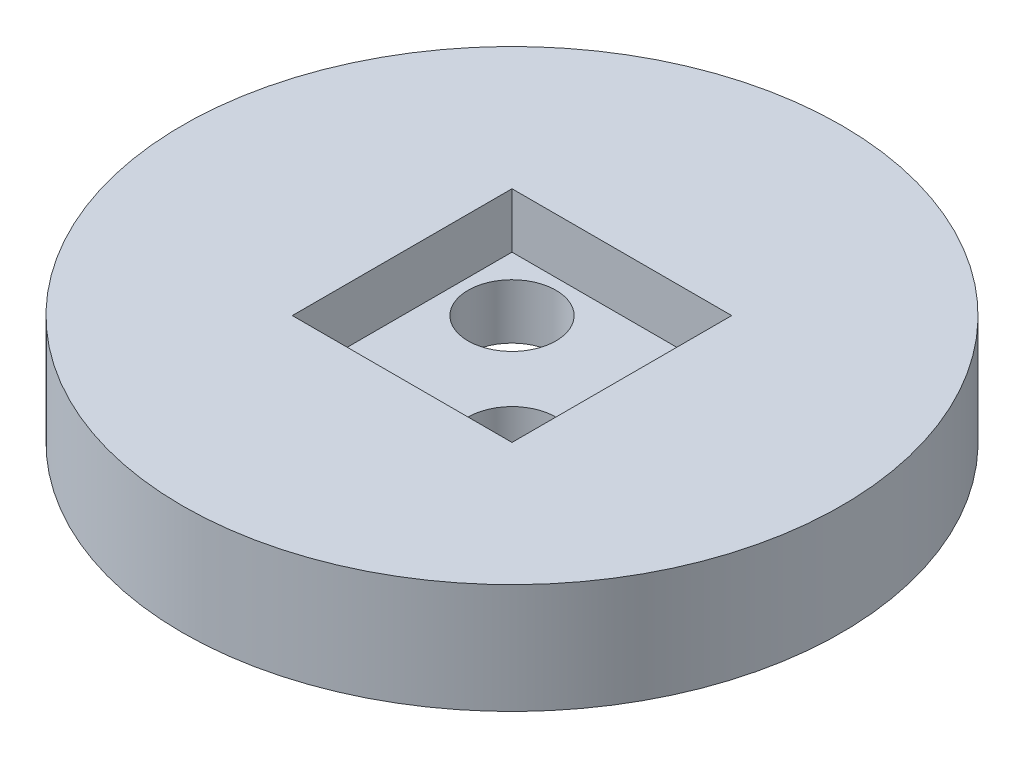
ISO-10303-21;
HEADER;
FILE_DESCRIPTION(('STEP AP214'),'2;1');
FILE_NAME('part.step','',(''),(''),'','','');
FILE_SCHEMA(('AUTOMOTIVE_DESIGN { 1 0 10303 214 1 1 1 1 }'));
ENDSEC;
DATA;
#1=APPLICATION_CONTEXT('core data for automotive mechanical design processes');
#2=APPLICATION_PROTOCOL_DEFINITION('international standard','automotive_design',2000,#1);
#3=PRODUCT_CONTEXT('',#1,'mechanical');
#4=PRODUCT('Part','Part','',(#3));
#5=PRODUCT_RELATED_PRODUCT_CATEGORY('part','',(#4));
#6=PRODUCT_DEFINITION_FORMATION('','',#4);
#7=PRODUCT_DEFINITION_CONTEXT('part definition',#1,'design');
#8=PRODUCT_DEFINITION('design','',#6,#7);
#9=PRODUCT_DEFINITION_SHAPE('','',#8);
#10=(LENGTH_UNIT() NAMED_UNIT(*) SI_UNIT(.MILLI.,.METRE.));
#11=(NAMED_UNIT(*) PLANE_ANGLE_UNIT() SI_UNIT($,.RADIAN.));
#12=(NAMED_UNIT(*) SI_UNIT($,.STERADIAN.) SOLID_ANGLE_UNIT());
#13=UNCERTAINTY_MEASURE_WITH_UNIT(LENGTH_MEASURE(1.E-05),#10,'distance_accuracy_value','');
#14=(GEOMETRIC_REPRESENTATION_CONTEXT(3) GLOBAL_UNCERTAINTY_ASSIGNED_CONTEXT((#13)) GLOBAL_UNIT_ASSIGNED_CONTEXT((#10,
#11,#12)) REPRESENTATION_CONTEXT('',''));
#15=CARTESIAN_POINT('',(0.,0.,0.));
#16=DIRECTION('',(0.,0.,1.));
#17=DIRECTION('',(1.,0.,0.));
#18=AXIS2_PLACEMENT_3D('',#15,#16,#17);
#19=CARTESIAN_POINT('',(0.,5.,0.));
#20=DIRECTION('',(0.,1.,0.));
#21=DIRECTION('',(0.,0.,1.));
#22=AXIS2_PLACEMENT_3D('',#19,#20,#21);
#23=PLANE('',#22);
#24=CARTESIAN_POINT('',(0.,5.,0.));
#25=DIRECTION('',(0.,1.,0.));
#26=DIRECTION('',(0.,0.,1.));
#27=AXIS2_PLACEMENT_3D('',#24,#25,#26);
#28=CIRCLE('',#27,15.);
#29=CARTESIAN_POINT('',(0.,5.,15.));
#30=VERTEX_POINT('',#29);
#31=EDGE_CURVE('E11',#30,#30,#28,.T.);
#32=ORIENTED_EDGE('',*,*,#31,.T.);
#33=EDGE_LOOP('',(#32));
#34=FACE_BOUND('',#33,.T.);
#35=DIRECTION('',(1.,0.,0.));
#36=VECTOR('',#35,1.);
#37=CARTESIAN_POINT('',(5.,5.,5.));
#38=LINE('',#37,#36);
#39=CARTESIAN_POINT('',(-5.,5.,5.));
#40=VERTEX_POINT('',#39);
#41=CARTESIAN_POINT('',(5.,5.,5.));
#42=VERTEX_POINT('',#41);
#43=EDGE_CURVE('E118',#40,#42,#38,.T.);
#44=ORIENTED_EDGE('',*,*,#43,.F.);
#45=DIRECTION('',(0.,0.,1.));
#46=VECTOR('',#45,1.);
#47=CARTESIAN_POINT('',(-5.,5.,5.));
#48=LINE('',#47,#46);
#49=CARTESIAN_POINT('',(-5.,5.,-5.));
#50=VERTEX_POINT('',#49);
#51=EDGE_CURVE('E101',#50,#40,#48,.T.);
#52=ORIENTED_EDGE('',*,*,#51,.F.);
#53=DIRECTION('',(-1.,0.,0.));
#54=VECTOR('',#53,1.);
#55=CARTESIAN_POINT('',(5.,5.,-5.));
#56=LINE('',#55,#54);
#57=CARTESIAN_POINT('',(5.,5.,-5.));
#58=VERTEX_POINT('',#57);
#59=EDGE_CURVE('E89',#58,#50,#56,.T.);
#60=ORIENTED_EDGE('',*,*,#59,.F.);
#61=DIRECTION('',(0.,0.,-1.));
#62=VECTOR('',#61,1.);
#63=CARTESIAN_POINT('',(5.,5.,5.));
#64=LINE('',#63,#62);
#65=EDGE_CURVE('E121',#42,#58,#64,.T.);
#66=ORIENTED_EDGE('',*,*,#65,.F.);
#67=EDGE_LOOP('',(#44,#52,#60,#66));
#68=FACE_BOUND('',#67,.T.);
#69=ADVANCED_FACE('F39',(#34,#68),#23,.T.);
#70=CARTESIAN_POINT('',(0.,0.,0.));
#71=DIRECTION('',(0.,1.,0.));
#72=DIRECTION('',(0.,0.,1.));
#73=AXIS2_PLACEMENT_3D('',#70,#71,#72);
#74=PLANE('',#73);
#75=CARTESIAN_POINT('',(-2.5,0.,-2.5));
#76=DIRECTION('',(0.,1.,0.));
#77=DIRECTION('',(0.,0.,1.));
#78=AXIS2_PLACEMENT_3D('',#75,#76,#77);
#79=CIRCLE('',#78,2.);
#80=CARTESIAN_POINT('',(-2.5,0.,-0.500000000000001));
#81=VERTEX_POINT('',#80);
#82=EDGE_CURVE('E105',#81,#81,#79,.T.);
#83=ORIENTED_EDGE('',*,*,#82,.T.);
#84=EDGE_LOOP('',(#83));
#85=FACE_BOUND('',#84,.T.);
#86=CARTESIAN_POINT('',(2.5,0.,2.5));
#87=DIRECTION('',(0.,1.,0.));
#88=DIRECTION('',(0.,0.,1.));
#89=AXIS2_PLACEMENT_3D('',#86,#87,#88);
#90=CIRCLE('',#89,2.);
#91=CARTESIAN_POINT('',(2.5,0.,4.5));
#92=VERTEX_POINT('',#91);
#93=EDGE_CURVE('E111',#92,#92,#90,.T.);
#94=ORIENTED_EDGE('',*,*,#93,.T.);
#95=EDGE_LOOP('',(#94));
#96=FACE_BOUND('',#95,.T.);
#97=CARTESIAN_POINT('',(0.,0.,0.));
#98=DIRECTION('',(0.,1.,0.));
#99=DIRECTION('',(0.,0.,1.));
#100=AXIS2_PLACEMENT_3D('',#97,#98,#99);
#101=CIRCLE('',#100,15.);
#102=CARTESIAN_POINT('',(0.,0.,15.));
#103=VERTEX_POINT('',#102);
#104=EDGE_CURVE('E43',#103,#103,#101,.T.);
#105=ORIENTED_EDGE('',*,*,#104,.F.);
#106=EDGE_LOOP('',(#105));
#107=FACE_BOUND('',#106,.T.);
#108=ADVANCED_FACE('F138',(#85,#96,#107),#74,.F.);
#109=CARTESIAN_POINT('',(0.,5.,0.));
#110=DIRECTION('',(0.,-1.,0.));
#111=DIRECTION('',(0.,0.,-1.));
#112=AXIS2_PLACEMENT_3D('',#109,#110,#111);
#113=CYLINDRICAL_SURFACE('',#112,15.);
#114=ORIENTED_EDGE('',*,*,#31,.F.);
#115=EDGE_LOOP('',(#114));
#116=FACE_BOUND('',#115,.T.);
#117=ORIENTED_EDGE('',*,*,#104,.T.);
#118=EDGE_LOOP('',(#117));
#119=FACE_BOUND('',#118,.T.);
#120=ADVANCED_FACE('F41',(#116,#119),#113,.T.);
#121=CARTESIAN_POINT('',(-5.,5.,5.));
#122=DIRECTION('',(1.,0.,0.));
#123=DIRECTION('',(0.,0.,-1.));
#124=AXIS2_PLACEMENT_3D('',#121,#122,#123);
#125=PLANE('',#124);
#126=DIRECTION('',(0.,0.,-1.));
#127=VECTOR('',#126,1.);
#128=CARTESIAN_POINT('',(-5.,2.5,5.));
#129=LINE('',#128,#127);
#130=CARTESIAN_POINT('',(-5.,2.5,5.));
#131=VERTEX_POINT('',#130);
#132=CARTESIAN_POINT('',(-5.,2.5,-5.));
#133=VERTEX_POINT('',#132);
#134=EDGE_CURVE('E96',#131,#133,#129,.T.);
#135=ORIENTED_EDGE('',*,*,#134,.T.);
#136=DIRECTION('',(0.,-1.,0.));
#137=VECTOR('',#136,1.);
#138=CARTESIAN_POINT('',(-5.,5.,-5.));
#139=LINE('',#138,#137);
#140=EDGE_CURVE('E83',#50,#133,#139,.T.);
#141=ORIENTED_EDGE('',*,*,#140,.F.);
#142=ORIENTED_EDGE('',*,*,#51,.T.);
#143=DIRECTION('',(0.,-1.,0.));
#144=VECTOR('',#143,1.);
#145=CARTESIAN_POINT('',(-5.,5.,5.));
#146=LINE('',#145,#144);
#147=EDGE_CURVE('E98',#40,#131,#146,.T.);
#148=ORIENTED_EDGE('',*,*,#147,.T.);
#149=EDGE_LOOP('',(#135,#141,#142,#148));
#150=FACE_BOUND('',#149,.T.);
#151=ADVANCED_FACE('F97',(#150),#125,.T.);
#152=CARTESIAN_POINT('',(5.,5.,5.));
#153=DIRECTION('',(0.,0.,-1.));
#154=DIRECTION('',(-1.,0.,0.));
#155=AXIS2_PLACEMENT_3D('',#152,#153,#154);
#156=PLANE('',#155);
#157=DIRECTION('',(1.,0.,0.));
#158=VECTOR('',#157,1.);
#159=CARTESIAN_POINT('',(0.,2.5,5.));
#160=LINE('',#159,#158);
#161=CARTESIAN_POINT('',(5.,2.5,5.));
#162=VERTEX_POINT('',#161);
#163=EDGE_CURVE('E55',#131,#162,#160,.T.);
#164=ORIENTED_EDGE('',*,*,#163,.F.);
#165=ORIENTED_EDGE('',*,*,#147,.F.);
#166=ORIENTED_EDGE('',*,*,#43,.T.);
#167=DIRECTION('',(0.,-1.,0.));
#168=VECTOR('',#167,1.);
#169=CARTESIAN_POINT('',(5.,5.,5.));
#170=LINE('',#169,#168);
#171=EDGE_CURVE('E129',#42,#162,#170,.T.);
#172=ORIENTED_EDGE('',*,*,#171,.T.);
#173=EDGE_LOOP('',(#164,#165,#166,#172));
#174=FACE_BOUND('',#173,.T.);
#175=ADVANCED_FACE('F154',(#174),#156,.T.);
#176=CARTESIAN_POINT('',(5.,5.,5.));
#177=DIRECTION('',(-1.,0.,0.));
#178=DIRECTION('',(0.,0.,1.));
#179=AXIS2_PLACEMENT_3D('',#176,#177,#178);
#180=PLANE('',#179);
#181=DIRECTION('',(0.,0.,-1.));
#182=VECTOR('',#181,1.);
#183=CARTESIAN_POINT('',(5.,2.5,5.));
#184=LINE('',#183,#182);
#185=CARTESIAN_POINT('',(5.,2.5,-5.));
#186=VERTEX_POINT('',#185);
#187=EDGE_CURVE('E63',#162,#186,#184,.T.);
#188=ORIENTED_EDGE('',*,*,#187,.F.);
#189=ORIENTED_EDGE('',*,*,#171,.F.);
#190=ORIENTED_EDGE('',*,*,#65,.T.);
#191=DIRECTION('',(0.,-1.,0.));
#192=VECTOR('',#191,1.);
#193=CARTESIAN_POINT('',(5.,5.,-5.));
#194=LINE('',#193,#192);
#195=EDGE_CURVE('E93',#58,#186,#194,.T.);
#196=ORIENTED_EDGE('',*,*,#195,.T.);
#197=EDGE_LOOP('',(#188,#189,#190,#196));
#198=FACE_BOUND('',#197,.T.);
#199=ADVANCED_FACE('F157',(#198),#180,.T.);
#200=CARTESIAN_POINT('',(5.,5.,-5.));
#201=DIRECTION('',(0.,0.,1.));
#202=DIRECTION('',(1.,0.,0.));
#203=AXIS2_PLACEMENT_3D('',#200,#201,#202);
#204=PLANE('',#203);
#205=DIRECTION('',(1.,0.,0.));
#206=VECTOR('',#205,1.);
#207=CARTESIAN_POINT('',(0.,2.5,-5.));
#208=LINE('',#207,#206);
#209=EDGE_CURVE('E87',#133,#186,#208,.T.);
#210=ORIENTED_EDGE('',*,*,#209,.T.);
#211=ORIENTED_EDGE('',*,*,#195,.F.);
#212=ORIENTED_EDGE('',*,*,#59,.T.);
#213=ORIENTED_EDGE('',*,*,#140,.T.);
#214=EDGE_LOOP('',(#210,#211,#212,#213));
#215=FACE_BOUND('',#214,.T.);
#216=ADVANCED_FACE('F85',(#215),#204,.T.);
#217=CARTESIAN_POINT('',(0.,2.5,5.));
#218=DIRECTION('',(0.,1.,0.));
#219=DIRECTION('',(0.,0.,1.));
#220=AXIS2_PLACEMENT_3D('',#217,#218,#219);
#221=PLANE('',#220);
#222=CARTESIAN_POINT('',(-2.5,2.5,-2.5));
#223=DIRECTION('',(0.,1.,0.));
#224=DIRECTION('',(0.,0.,1.));
#225=AXIS2_PLACEMENT_3D('',#222,#223,#224);
#226=CIRCLE('',#225,2.);
#227=CARTESIAN_POINT('',(-2.5,2.5,-0.500000000000001));
#228=VERTEX_POINT('',#227);
#229=EDGE_CURVE('E176',#228,#228,#226,.T.);
#230=ORIENTED_EDGE('',*,*,#229,.F.);
#231=EDGE_LOOP('',(#230));
#232=FACE_BOUND('',#231,.T.);
#233=CARTESIAN_POINT('',(2.5,2.5,2.5));
#234=DIRECTION('',(0.,1.,0.));
#235=DIRECTION('',(0.,0.,1.));
#236=AXIS2_PLACEMENT_3D('',#233,#234,#235);
#237=CIRCLE('',#236,2.);
#238=CARTESIAN_POINT('',(2.5,2.5,4.5));
#239=VERTEX_POINT('',#238);
#240=EDGE_CURVE('E179',#239,#239,#237,.T.);
#241=ORIENTED_EDGE('',*,*,#240,.F.);
#242=EDGE_LOOP('',(#241));
#243=FACE_BOUND('',#242,.T.);
#244=ORIENTED_EDGE('',*,*,#209,.F.);
#245=ORIENTED_EDGE('',*,*,#134,.F.);
#246=ORIENTED_EDGE('',*,*,#163,.T.);
#247=ORIENTED_EDGE('',*,*,#187,.T.);
#248=EDGE_LOOP('',(#244,#245,#246,#247));
#249=FACE_BOUND('',#248,.T.);
#250=ADVANCED_FACE('F103',(#232,#243,#249),#221,.T.);
#251=CARTESIAN_POINT('',(2.5,-7.5,2.5));
#252=DIRECTION('',(0.,1.,0.));
#253=DIRECTION('',(0.,0.,1.));
#254=AXIS2_PLACEMENT_3D('',#251,#252,#253);
#255=CYLINDRICAL_SURFACE('',#254,2.);
#256=ORIENTED_EDGE('',*,*,#240,.T.);
#257=EDGE_LOOP('',(#256));
#258=FACE_BOUND('',#257,.T.);
#259=ORIENTED_EDGE('',*,*,#93,.F.);
#260=EDGE_LOOP('',(#259));
#261=FACE_BOUND('',#260,.T.);
#262=ADVANCED_FACE('F163',(#258,#261),#255,.F.);
#263=CARTESIAN_POINT('',(-2.5,-7.5,-2.5));
#264=DIRECTION('',(0.,1.,0.));
#265=DIRECTION('',(0.,0.,1.));
#266=AXIS2_PLACEMENT_3D('',#263,#264,#265);
#267=CYLINDRICAL_SURFACE('',#266,2.);
#268=ORIENTED_EDGE('',*,*,#229,.T.);
#269=EDGE_LOOP('',(#268));
#270=FACE_BOUND('',#269,.T.);
#271=ORIENTED_EDGE('',*,*,#82,.F.);
#272=EDGE_LOOP('',(#271));
#273=FACE_BOUND('',#272,.T.);
#274=ADVANCED_FACE('F167',(#270,#273),#267,.F.);
#275=CLOSED_SHELL('',(#69,#108,#120,#151,#175,#199,#216,#250,#262,#274));
#276=MANIFOLD_SOLID_BREP('B2',#275);
#277=ADVANCED_BREP_SHAPE_REPRESENTATION('',(#18,#276),#14);
#278=SHAPE_DEFINITION_REPRESENTATION(#9,#277);
ENDSEC;
END-ISO-10303-21;
